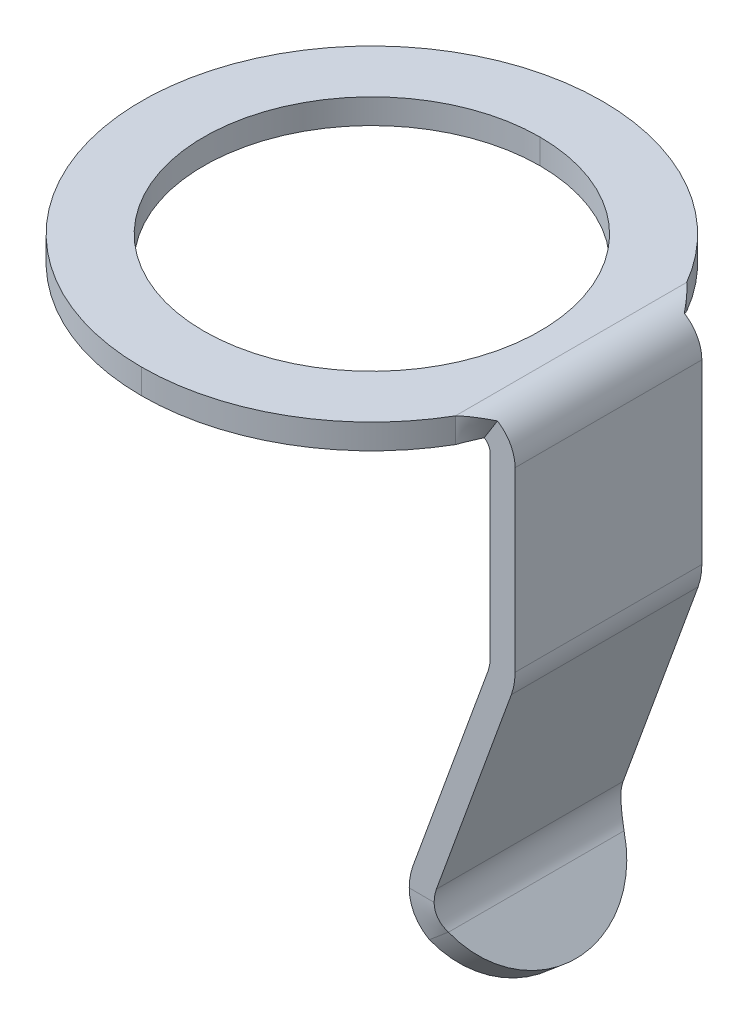
ISO-10303-21;
HEADER;
FILE_DESCRIPTION(('STEP AP214'),'2;1');
FILE_NAME('part.step','',(''),(''),'','','');
FILE_SCHEMA(('AUTOMOTIVE_DESIGN { 1 0 10303 214 1 1 1 1 }'));
ENDSEC;
DATA;
#1=APPLICATION_CONTEXT('core data for automotive mechanical design processes');
#2=APPLICATION_PROTOCOL_DEFINITION('international standard','automotive_design',2000,#1);
#3=PRODUCT_CONTEXT('',#1,'mechanical');
#4=PRODUCT('Part','Part','',(#3));
#5=PRODUCT_RELATED_PRODUCT_CATEGORY('part','',(#4));
#6=PRODUCT_DEFINITION_FORMATION('','',#4);
#7=PRODUCT_DEFINITION_CONTEXT('part definition',#1,'design');
#8=PRODUCT_DEFINITION('design','',#6,#7);
#9=PRODUCT_DEFINITION_SHAPE('','',#8);
#10=(LENGTH_UNIT() NAMED_UNIT(*) SI_UNIT(.MILLI.,.METRE.));
#11=(NAMED_UNIT(*) PLANE_ANGLE_UNIT() SI_UNIT($,.RADIAN.));
#12=(NAMED_UNIT(*) SI_UNIT($,.STERADIAN.) SOLID_ANGLE_UNIT());
#13=UNCERTAINTY_MEASURE_WITH_UNIT(LENGTH_MEASURE(1.E-05),#10,'distance_accuracy_value','');
#14=(GEOMETRIC_REPRESENTATION_CONTEXT(3) GLOBAL_UNCERTAINTY_ASSIGNED_CONTEXT((#13)) GLOBAL_UNIT_ASSIGNED_CONTEXT((#10,
#11,#12)) REPRESENTATION_CONTEXT('',''));
#15=CARTESIAN_POINT('',(0.,0.,0.));
#16=DIRECTION('',(0.,0.,1.));
#17=DIRECTION('',(1.,0.,0.));
#18=AXIS2_PLACEMENT_3D('',#15,#16,#17);
#19=CARTESIAN_POINT('',(-1.066044443119,-7.542787609687,4.));
#20=DIRECTION('',(-0.766044443119007,-0.642787609686505,0.));
#21=DIRECTION('',(-0.642787609686505,0.766044443119007,0.));
#22=AXIS2_PLACEMENT_3D('',#19,#20,#21);
#23=PLANE('',#22);
#24=CARTESIAN_POINT('',(-1.39484922021393,-7.15093333532141,0.));
#25=DIRECTION('',(0.766044443119006,0.642787609686506,0.));
#26=DIRECTION('',(-0.642787609686506,0.766044443119007,0.));
#27=AXIS2_PLACEMENT_3D('',#24,#25,#26);
#28=CIRCLE('',#27,1.5);
#29=CARTESIAN_POINT('',(-1.06604444311903,-7.54278760968672,1.41008426919146));
#30=VERTEX_POINT('',#29);
#31=CARTESIAN_POINT('',(-1.06604444311892,-7.54278760968658,-1.41008426919181));
#32=VERTEX_POINT('',#31);
#33=EDGE_CURVE('E11',#30,#32,#28,.T.);
#34=ORIENTED_EDGE('',*,*,#33,.F.);
#35=DIRECTION('',(0.,0.,1.));
#36=VECTOR('',#35,1.);
#37=CARTESIAN_POINT('',(-1.06604444311876,-7.5427876096868,4.));
#38=LINE('',#37,#36);
#39=EDGE_CURVE('E28',#32,#30,#38,.T.);
#40=ORIENTED_EDGE('',*,*,#39,.F.);
#41=EDGE_LOOP('',(#34,#40));
#42=FACE_BOUND('',#41,.T.);
#43=ADVANCED_FACE('F17',(#42),#23,.T.);
#44=CARTESIAN_POINT('',(-1.24164033159,-7.022375813384,0.));
#45=DIRECTION('',(0.766044443119007,0.642787609686505,0.));
#46=DIRECTION('',(-0.642787609686505,0.766044443119007,0.));
#47=AXIS2_PLACEMENT_3D('',#44,#45,#46);
#48=CYLINDRICAL_SURFACE('',#47,1.5);
#49=DIRECTION('',(-0.766044443120241,-0.642787609685034,0.));
#50=VECTOR('',#49,1.);
#51=CARTESIAN_POINT('',(-0.912876692884262,-7.41426460695659,-1.41008426919162));
#52=LINE('',#51,#50);
#53=CARTESIAN_POINT('',(-0.759626665871204,-7.28567256581219,-1.41008426919181));
#54=VERTEX_POINT('',#53);
#55=EDGE_CURVE('E279',#54,#32,#52,.T.);
#56=ORIENTED_EDGE('',*,*,#55,.F.);
#57=CARTESIAN_POINT('',(-1.08843144296639,-6.89381829144686,0.));
#58=DIRECTION('',(-0.766044443119006,-0.642787609686506,0.));
#59=DIRECTION('',(-0.642787609686506,0.766044443119007,0.));
#60=AXIS2_PLACEMENT_3D('',#57,#58,#59);
#61=CIRCLE('',#60,1.5);
#62=CARTESIAN_POINT('',(-0.759626665871298,-7.28567256581181,1.41008426919151));
#63=VERTEX_POINT('',#62);
#64=EDGE_CURVE('E192',#54,#63,#61,.T.);
#65=ORIENTED_EDGE('',*,*,#64,.T.);
#66=DIRECTION('',(-0.766044443119007,-0.642787609686505,0.));
#67=VECTOR('',#66,1.);
#68=CARTESIAN_POINT('',(-0.91283555449511,-7.41423008774901,1.41008426919154));
#69=LINE('',#68,#67);
#70=EDGE_CURVE('E193',#63,#30,#69,.T.);
#71=ORIENTED_EDGE('',*,*,#70,.T.);
#72=ORIENTED_EDGE('',*,*,#33,.T.);
#73=EDGE_LOOP('',(#56,#65,#71,#72));
#74=FACE_BOUND('',#73,.T.);
#75=ADVANCED_FACE('F303',(#74),#48,.T.);
#76=CARTESIAN_POINT('',(-0.3,-6.9,4.));
#77=DIRECTION('',(0.,0.,1.));
#78=DIRECTION('',(1.,0.,0.));
#79=AXIS2_PLACEMENT_3D('',#76,#77,#78);
#80=CYLINDRICAL_SURFACE('',#79,1.);
#81=CARTESIAN_POINT('',(-1.29973863530956,-6.87729710458656,1.499945644614));
#82=CARTESIAN_POINT('',(-1.29987384145526,-6.88314001843995,1.499981885997));
#83=CARTESIAN_POINT('',(-1.3016461980201,-7.00859734865777,1.500370746386));
#84=CARTESIAN_POINT('',(-1.25799426251989,-7.25376408101686,1.484823577251));
#85=CARTESIAN_POINT('',(-1.13542213086136,-7.46156779895759,1.438660254774));
#86=CARTESIAN_POINT('',(-1.05900488679946,-7.55110616142862,1.407189948817));
#87=CARTESIAN_POINT('',(-1.05544198904331,-7.55521074868514,1.405717663264));
#88=(BOUNDED_CURVE() B_SPLINE_CURVE(3,(#81,#82,#83,#84,#85,#86,#87),.UNSPECIFIED.,.F.,
.F.) B_SPLINE_CURVE_WITH_KNOTS((4,1,1,1,4),(-0.02442910242718,0.,0.5,1.,1.02424720941),
.UNSPECIFIED.) CURVE() GEOMETRIC_REPRESENTATION_ITEM() RATIONAL_B_SPLINE_CURVE((1.,1.,1.,1.,1.,
1.,1.)) REPRESENTATION_ITEM(''));
#89=CARTESIAN_POINT('',(-1.29998662667951,-6.89482830181338,1.49999999999995));
#90=VERTEX_POINT('',#89);
#91=EDGE_CURVE('E181',#90,#30,#88,.T.);
#92=ORIENTED_EDGE('',*,*,#91,.F.);
#93=CARTESIAN_POINT('',(-0.3,-6.9,1.5));
#94=DIRECTION('',(0.,0.,1.));
#95=DIRECTION('',(1.,0.,0.));
#96=AXIS2_PLACEMENT_3D('',#93,#94,#95);
#97=CIRCLE('',#96,1.);
#98=CARTESIAN_POINT('',(-1.23969262078594,-6.55797985667413,1.5));
#99=VERTEX_POINT('',#98);
#100=EDGE_CURVE('E186',#99,#90,#97,.T.);
#101=ORIENTED_EDGE('',*,*,#100,.F.);
#102=DIRECTION('',(0.,0.,1.));
#103=VECTOR('',#102,1.);
#104=CARTESIAN_POINT('',(-1.23969262078587,-6.55797985667405,4.));
#105=LINE('',#104,#103);
#106=CARTESIAN_POINT('',(-1.23969262078594,-6.55797985667413,-1.5));
#107=VERTEX_POINT('',#106);
#108=EDGE_CURVE('E152',#107,#99,#105,.T.);
#109=ORIENTED_EDGE('',*,*,#108,.F.);
#110=CARTESIAN_POINT('',(-0.3,-6.9,-1.5));
#111=DIRECTION('',(0.,0.,1.));
#112=DIRECTION('',(1.,0.,0.));
#113=AXIS2_PLACEMENT_3D('',#110,#111,#112);
#114=CIRCLE('',#113,1.);
#115=CARTESIAN_POINT('',(-1.29998662667951,-6.89482830181305,-1.50000000000017));
#116=VERTEX_POINT('',#115);
#117=EDGE_CURVE('E270',#107,#116,#114,.T.);
#118=ORIENTED_EDGE('',*,*,#117,.T.);
#119=CARTESIAN_POINT('',(-1.05545359878585,-7.55519737359482,-1.405722460706));
#120=CARTESIAN_POINT('',(-1.05901256477649,-7.55109716503239,-1.407193110772));
#121=CARTESIAN_POINT('',(-1.13542528260258,-7.46156245562721,-1.438661441787));
#122=CARTESIAN_POINT('',(-1.25799426251993,-7.25376408101687,-1.484823577251));
#123=CARTESIAN_POINT('',(-1.30164625639043,-7.00859702082559,-1.500370767175));
#124=CARTESIAN_POINT('',(-1.29987383219604,-6.88313936303207,-1.499981883966));
#125=CARTESIAN_POINT('',(-1.29973861256442,-6.87729612167255,-1.499945638518));
#126=(BOUNDED_CURVE() B_SPLINE_CURVE(3,(#119,#120,#121,#122,#123,#124,#125),.UNSPECIFIED.,.F.,
.F.) B_SPLINE_CURVE_WITH_KNOTS((4,1,1,1,4),(-0.02422087257923,0.,0.5,1.,1.024430472275),
.UNSPECIFIED.) CURVE() GEOMETRIC_REPRESENTATION_ITEM() RATIONAL_B_SPLINE_CURVE((1.,1.,1.,1.,1.,
1.,1.)) REPRESENTATION_ITEM(''));
#127=EDGE_CURVE('E167',#32,#116,#126,.T.);
#128=ORIENTED_EDGE('',*,*,#127,.F.);
#129=ORIENTED_EDGE('',*,*,#39,.T.);
#130=EDGE_LOOP('',(#92,#101,#109,#118,#128,#129));
#131=FACE_BOUND('',#130,.T.);
#132=ADVANCED_FACE('F184',(#131),#80,.T.);
#133=CARTESIAN_POINT('',(-1.07158855187,-7.569191057523,-1.405722460706));
#134=CARTESIAN_POINT('',(-0.9601318163994,-7.472525742185,-1.405722460706));
#135=CARTESIAN_POINT('',(-0.8486750809292,-7.375860426848,-1.405722460706));
#136=CARTESIAN_POINT('',(-0.7372183454589,-7.27919511151,-1.405722460706));
#137=CARTESIAN_POINT('',(-1.075223530139,-7.565003276841,-1.407193110772));
#138=CARTESIAN_POINT('',(-0.9632417184344,-7.468942890598,-1.407193110772));
#139=CARTESIAN_POINT('',(-0.8512599067296,-7.372882504354,-1.407193110772));
#140=CARTESIAN_POINT('',(-0.7392780950248,-7.27682211811,-1.407193110772));
#141=CARTESIAN_POINT('',(-1.153268268276,-7.473556288061,-1.438661441787));
#142=CARTESIAN_POINT('',(-1.030012816349,-7.390705510505,-1.438661441787));
#143=CARTESIAN_POINT('',(-0.9067573644216,-7.307854732949,-1.438661441787));
#144=CARTESIAN_POINT('',(-0.7835019124946,-7.225003955393,-1.438661441787));
#145=CARTESIAN_POINT('',(-1.27845507243,-7.261319762609,-1.484823577251));
#146=CARTESIAN_POINT('',(-1.137116261851,-7.209126762721,-1.484823577251));
#147=CARTESIAN_POINT('',(-0.9957774512727,-7.156933762833,-1.484823577251));
#148=CARTESIAN_POINT('',(-0.854438640694,-7.104740762945,-1.484823577251));
#149=CARTESIAN_POINT('',(-1.323039384148,-7.01091643242,-1.500370767175));
#150=CARTESIAN_POINT('',(-1.175260325298,-6.994894443191,-1.500370767175));
#151=CARTESIAN_POINT('',(-1.027481266448,-6.978872453961,-1.500370767175));
#152=CARTESIAN_POINT('',(-0.8797022075983,-6.962850464732,-1.500370767175));
#153=CARTESIAN_POINT('',(-1.321229104576,-6.882779254103,-1.499981883966));
#154=CARTESIAN_POINT('',(-1.173711542415,-6.885266808014,-1.499981883966));
#155=CARTESIAN_POINT('',(-1.026193980254,-6.887754361925,-1.499981883966));
#156=CARTESIAN_POINT('',(-0.8786764180927,-6.890241915837,-1.499981883966));
#157=CARTESIAN_POINT('',(-1.321090996928,-6.876811212987,-1.499945638518));
#158=CARTESIAN_POINT('',(-1.173593384554,-6.880160856386,-1.499945638518));
#159=CARTESIAN_POINT('',(-1.02609577218,-6.883510499786,-1.499945638518));
#160=CARTESIAN_POINT('',(-0.8785981598066,-6.886860143186,-1.499945638518));
#161=(BOUNDED_SURFACE() B_SPLINE_SURFACE(3,3,((#133,#134,#135,#136),(#137,#138,#139,#140),(#141,
#142,#143,#144),(#145,#146,#147,#148),(#149,#150,#151,#152),(#153,#154,#155,#156),(#157,#158,
#159,#160)),.UNSPECIFIED.,.F.,.F.,.F.) B_SPLINE_SURFACE_WITH_KNOTS((4,1,1,1,4),(4,4),
(-0.02422087257923,0.,0.5,1.,1.024430472275),(-0.05339491767018,1.053126405904),
.UNSPECIFIED.) GEOMETRIC_REPRESENTATION_ITEM() RATIONAL_B_SPLINE_SURFACE(((1.,1.,1.,1.),(1.,1.,
1.,1.),(1.,1.,1.,1.),(1.,1.,1.,1.),(1.,1.,1.,1.),(1.,1.,1.,1.),(1.,1.,1.,1.))) REPRESENTATION_ITEM('') SURFACE());
#162=DIRECTION('',(0.999986626679514,-0.00517169818593002,0.));
#163=VECTOR('',#162,1.);
#164=CARTESIAN_POINT('',(-1.10004300297853,-6.8958623637179,-1.50000000000034));
#165=LINE('',#164,#163);
#166=CARTESIAN_POINT('',(-0.899991976007704,-6.89689698108762,-1.50000000000017));
#167=VERTEX_POINT('',#166);
#168=EDGE_CURVE('E267',#116,#167,#165,.T.);
#169=CARTESIAN_POINT('',(-0.899843167538279,-6.8863776730037,-1.499945638518));
#170=CARTESIAN_POINT('',(-0.899924299317655,-6.88988361781955,-1.499981883966));
#171=CARTESIAN_POINT('',(-0.900987753834085,-6.96515821249531,-1.500370767175));
#172=CARTESIAN_POINT('',(-0.874796557511855,-7.11225844860999,-1.484823577251));
#173=CARTESIAN_POINT('',(-0.801255169561105,-7.23693747337631,-1.438661441787));
#174=CARTESIAN_POINT('',(-0.755407538865916,-7.29065829901912,-1.407193110772));
#175=CARTESIAN_POINT('',(-0.753272159271284,-7.29311842415686,-1.405722460706));
#176=(BOUNDED_CURVE() B_SPLINE_CURVE(3,(#169,#170,#171,#172,#173,#174,#175),.UNSPECIFIED.,.F.,
.F.) B_SPLINE_CURVE_WITH_KNOTS((4,1,1,1,4),(-0.0242208725792301,0.000209599695769835,
0.50020959969577,1.00020959969577,1.024430472275),
.UNSPECIFIED.) CURVE() GEOMETRIC_REPRESENTATION_ITEM() RATIONAL_B_SPLINE_CURVE((1.,1.,1.,1.,1.,
1.,1.)) REPRESENTATION_ITEM(''));
#177=EDGE_CURVE('E350',#167,#54,#176,.T.);
#178=ORIENTED_EDGE('',*,*,#168,.T.);
#179=ORIENTED_EDGE('',*,*,#177,.T.);
#180=ORIENTED_EDGE('',*,*,#55,.T.);
#181=ORIENTED_EDGE('',*,*,#127,.T.);
#182=EDGE_LOOP('',(#178,#179,#180,#181));
#183=FACE_BOUND('',#182,.T.);
#184=ADVANCED_FACE('F302',(#183),#161,.T.);
#185=CARTESIAN_POINT('',(-0.7596266658714,-7.285672565812,4.));
#186=DIRECTION('',(-0.766044443119007,-0.642787609686505,0.));
#187=DIRECTION('',(-0.642787609686505,0.766044443119007,0.));
#188=AXIS2_PLACEMENT_3D('',#185,#186,#187);
#189=PLANE('',#188);
#190=DIRECTION('',(0.,0.,1.));
#191=VECTOR('',#190,1.);
#192=CARTESIAN_POINT('',(-0.759626665871355,-7.28567256581196,4.));
#193=LINE('',#192,#191);
#194=EDGE_CURVE('E381',#54,#63,#193,.T.);
#195=ORIENTED_EDGE('',*,*,#194,.T.);
#196=ORIENTED_EDGE('',*,*,#64,.F.);
#197=EDGE_LOOP('',(#195,#196));
#198=FACE_BOUND('',#197,.T.);
#199=ADVANCED_FACE('F246',(#198),#189,.F.);
#200=CARTESIAN_POINT('',(-1.321091020159,-6.876812216894,1.499945644614));
#201=CARTESIAN_POINT('',(-1.173593404429,-6.880161715278,1.499945644614));
#202=CARTESIAN_POINT('',(-1.0260957887,-6.883511213663,1.499945644614));
#203=CARTESIAN_POINT('',(-0.8785981729704,-6.886860712047,1.499945644614));
#204=CARTESIAN_POINT('',(-1.321229114033,-6.882779923509,1.499981885997));
#205=CARTESIAN_POINT('',(-1.173711550506,-6.885267380724,1.499981885997));
#206=CARTESIAN_POINT('',(-1.026193986979,-6.887754837939,1.499981885997));
#207=CARTESIAN_POINT('',(-0.8786764234514,-6.890242295153,1.499981885997));
#208=CARTESIAN_POINT('',(-1.323039324531,-7.010916767254,1.500370746386));
#209=CARTESIAN_POINT('',(-1.175260274293,-6.994894729658,1.500370746386));
#210=CARTESIAN_POINT('',(-1.027481224055,-6.978872692061,1.500370746386));
#211=CARTESIAN_POINT('',(-0.8797021738164,-6.962850654465,1.500370746386));
#212=CARTESIAN_POINT('',(-1.27845507243,-7.261319762609,1.484823577251));
#213=CARTESIAN_POINT('',(-1.137116261851,-7.209126762721,1.484823577251));
#214=CARTESIAN_POINT('',(-0.9957774512727,-7.156933762833,1.484823577251));
#215=CARTESIAN_POINT('',(-0.854438640694,-7.104740762945,1.484823577251));
#216=CARTESIAN_POINT('',(-1.15326504922,-7.473561745514,1.438660254774));
#217=CARTESIAN_POINT('',(-1.030010062289,-7.390710179624,1.438660254774));
#218=CARTESIAN_POINT('',(-0.9067550753578,-7.307858613733,1.438660254774));
#219=CARTESIAN_POINT('',(-0.7835000884266,-7.225007047843,1.438660254774));
#220=CARTESIAN_POINT('',(-1.075215688176,-7.565012465382,1.407189948817));
#221=CARTESIAN_POINT('',(-0.9632350092509,-7.468950751845,1.407189948817));
#222=CARTESIAN_POINT('',(-0.8512543303254,-7.372889038307,1.407189948817));
#223=CARTESIAN_POINT('',(-0.7392736514,-7.27682732477,1.407189948817));
#224=CARTESIAN_POINT('',(-1.071576694167,-7.569204718278,1.405717663264));
#225=CARTESIAN_POINT('',(-0.9601216715533,-7.472537429631,1.405717663264));
#226=CARTESIAN_POINT('',(-0.8486666489401,-7.375870140983,1.405717663264));
#227=CARTESIAN_POINT('',(-0.7372116263268,-7.279202852336,1.405717663264));
#228=(BOUNDED_SURFACE() B_SPLINE_SURFACE(3,3,((#200,#201,#202,#203),(#204,#205,#206,#207),(#208,
#209,#210,#211),(#212,#213,#214,#215),(#216,#217,#218,#219),(#220,#221,#222,#223),(#224,#225,
#226,#227)),.UNSPECIFIED.,.F.,.F.,.F.) B_SPLINE_SURFACE_WITH_KNOTS((4,1,1,1,4),(4,4),
(-0.02442910242718,0.,0.5,1.,1.02424720941),(-0.05339491767018,1.053126405904),
.UNSPECIFIED.) GEOMETRIC_REPRESENTATION_ITEM() RATIONAL_B_SPLINE_SURFACE(((1.,1.,1.,1.),(1.,1.,
1.,1.),(1.,1.,1.,1.),(1.,1.,1.,1.),(1.,1.,1.,1.),(1.,1.,1.,1.),(1.,1.,1.,1.))) REPRESENTATION_ITEM('') SURFACE());
#229=CARTESIAN_POINT('',(-0.753265193425411,-7.29312644921077,1.405717663264));
#230=CARTESIAN_POINT('',(-0.755402932079564,-7.29066369685729,1.407189948817));
#231=CARTESIAN_POINT('',(-0.801253278516594,-7.23694067937485,1.438660254774));
#232=CARTESIAN_POINT('',(-0.874796557511578,-7.11225844860989,1.484823577251));
#233=CARTESIAN_POINT('',(-0.900987718811578,-6.96515840919488,1.500370746386));
#234=CARTESIAN_POINT('',(-0.89992430487286,-6.88988401106356,1.499981885997));
#235=CARTESIAN_POINT('',(-0.899843181185197,-6.88637826275226,1.499945644614));
#236=(BOUNDED_CURVE() B_SPLINE_CURVE(3,(#229,#230,#231,#232,#233,#234,#235),.UNSPECIFIED.,.F.,
.F.) B_SPLINE_CURVE_WITH_KNOTS((4,1,1,1,4),(-0.02442910242718,-0.000181893017179857,
0.49981810698282,0.99981810698282,1.02424720941),
.UNSPECIFIED.) CURVE() GEOMETRIC_REPRESENTATION_ITEM() RATIONAL_B_SPLINE_CURVE((1.,1.,1.,1.,1.,
1.,1.)) REPRESENTATION_ITEM(''));
#237=CARTESIAN_POINT('',(-0.899991976007708,-6.89689698108836,1.49999999999995));
#238=VERTEX_POINT('',#237);
#239=EDGE_CURVE('E200',#63,#238,#236,.T.);
#240=DIRECTION('',(-0.999986626679507,0.00517169818737915,0.));
#241=VECTOR('',#240,1.);
#242=CARTESIAN_POINT('',(-1.10004300297865,-6.89586236371888,1.4999999999999));
#243=LINE('',#242,#241);
#244=EDGE_CURVE('E197',#238,#90,#243,.T.);
#245=ORIENTED_EDGE('',*,*,#70,.F.);
#246=ORIENTED_EDGE('',*,*,#239,.T.);
#247=ORIENTED_EDGE('',*,*,#244,.T.);
#248=ORIENTED_EDGE('',*,*,#91,.T.);
#249=EDGE_LOOP('',(#245,#246,#247,#248));
#250=FACE_BOUND('',#249,.T.);
#251=ADVANCED_FACE('F198',(#250),#228,.T.);
#252=CARTESIAN_POINT('',(-0.03618442752846,-3.251368271571,4.));
#253=DIRECTION('',(-0.939692620785897,0.342020143325699,0.));
#254=DIRECTION('',(0.,0.,1.));
#255=AXIS2_PLACEMENT_3D('',#252,#253,#254);
#256=PLANE('',#255);
#257=ORIENTED_EDGE('',*,*,#108,.T.);
#258=DIRECTION('',(-0.342020143325734,-0.939692620785885,0.));
#259=VECTOR('',#258,1.);
#260=CARTESIAN_POINT('',(-0.03618442752846,-3.251368271571,1.5));
#261=LINE('',#260,#259);
#262=CARTESIAN_POINT('',(-0.0361844275284646,-3.25136827157072,1.5));
#263=VERTEX_POINT('',#262);
#264=EDGE_CURVE('E211',#263,#99,#261,.T.);
#265=ORIENTED_EDGE('',*,*,#264,.F.);
#266=DIRECTION('',(0.,0.,-1.));
#267=VECTOR('',#266,1.);
#268=CARTESIAN_POINT('',(-0.0361844275286479,-3.25136827157093,4.));
#269=LINE('',#268,#267);
#270=CARTESIAN_POINT('',(-0.0361844275284646,-3.25136827157072,-1.5));
#271=VERTEX_POINT('',#270);
#272=EDGE_CURVE('E385',#263,#271,#269,.T.);
#273=ORIENTED_EDGE('',*,*,#272,.T.);
#274=DIRECTION('',(-0.342020143325734,-0.939692620785885,0.));
#275=VECTOR('',#274,1.);
#276=CARTESIAN_POINT('',(-0.03618442752846,-3.251368271571,-1.5));
#277=LINE('',#276,#275);
#278=EDGE_CURVE('E276',#271,#107,#277,.T.);
#279=ORIENTED_EDGE('',*,*,#278,.T.);
#280=EDGE_LOOP('',(#257,#265,#273,#279));
#281=FACE_BOUND('',#280,.T.);
#282=ADVANCED_FACE('F245',(#281),#256,.T.);
#283=CARTESIAN_POINT('',(-0.3,-6.9,4.));
#284=DIRECTION('',(0.,0.,1.));
#285=DIRECTION('',(1.,0.,0.));
#286=AXIS2_PLACEMENT_3D('',#283,#284,#285);
#287=CYLINDRICAL_SURFACE('',#286,0.6);
#288=ORIENTED_EDGE('',*,*,#194,.F.);
#289=ORIENTED_EDGE('',*,*,#177,.F.);
#290=CARTESIAN_POINT('',(-0.3,-6.9,-1.5));
#291=DIRECTION('',(0.,0.,1.));
#292=DIRECTION('',(1.,0.,0.));
#293=AXIS2_PLACEMENT_3D('',#290,#291,#292);
#294=CIRCLE('',#293,0.6);
#295=CARTESIAN_POINT('',(-0.863815572471685,-6.69478791400475,-1.5));
#296=VERTEX_POINT('',#295);
#297=EDGE_CURVE('E271',#296,#167,#294,.T.);
#298=ORIENTED_EDGE('',*,*,#297,.F.);
#299=DIRECTION('',(0.,0.,1.));
#300=VECTOR('',#299,1.);
#301=CARTESIAN_POINT('',(-0.863815572471832,-6.69478791400492,4.));
#302=LINE('',#301,#300);
#303=CARTESIAN_POINT('',(-0.863815572471685,-6.69478791400475,1.5));
#304=VERTEX_POINT('',#303);
#305=EDGE_CURVE('E482',#296,#304,#302,.T.);
#306=ORIENTED_EDGE('',*,*,#305,.T.);
#307=CARTESIAN_POINT('',(-0.3,-6.9,1.5));
#308=DIRECTION('',(0.,0.,-1.));
#309=DIRECTION('',(1.,0.,0.));
#310=AXIS2_PLACEMENT_3D('',#307,#308,#309);
#311=CIRCLE('',#310,0.6);
#312=EDGE_CURVE('E206',#238,#304,#311,.T.);
#313=ORIENTED_EDGE('',*,*,#312,.F.);
#314=ORIENTED_EDGE('',*,*,#239,.F.);
#315=EDGE_LOOP('',(#288,#289,#298,#306,#313,#314));
#316=FACE_BOUND('',#315,.T.);
#317=ADVANCED_FACE('F356',(#316),#287,.F.);
#318=CARTESIAN_POINT('',(-0.6,-3.046156185575,4.));
#319=DIRECTION('',(0.,0.,1.));
#320=DIRECTION('',(1.,0.,0.));
#321=AXIS2_PLACEMENT_3D('',#318,#319,#320);
#322=CYLINDRICAL_SURFACE('',#321,0.6);
#323=CARTESIAN_POINT('',(-0.6,-3.046156185575,-1.5));
#324=DIRECTION('',(0.,0.,-1.));
#325=DIRECTION('',(1.,0.,0.));
#326=AXIS2_PLACEMENT_3D('',#323,#324,#325);
#327=CIRCLE('',#326,0.6);
#328=CARTESIAN_POINT('',(0.,-3.046156185575,-1.5));
#329=VERTEX_POINT('',#328);
#330=EDGE_CURVE('E492',#329,#271,#327,.T.);
#331=ORIENTED_EDGE('',*,*,#330,.T.);
#332=ORIENTED_EDGE('',*,*,#272,.F.);
#333=CARTESIAN_POINT('',(-0.6,-3.046156185575,1.5));
#334=DIRECTION('',(0.,0.,-1.));
#335=DIRECTION('',(1.,0.,0.));
#336=AXIS2_PLACEMENT_3D('',#333,#334,#335);
#337=CIRCLE('',#336,0.6);
#338=CARTESIAN_POINT('',(0.,-3.046156185575,1.5));
#339=VERTEX_POINT('',#338);
#340=EDGE_CURVE('E218',#339,#263,#337,.T.);
#341=ORIENTED_EDGE('',*,*,#340,.F.);
#342=DIRECTION('',(0.,0.,1.));
#343=VECTOR('',#342,1.);
#344=CARTESIAN_POINT('',(0.,-3.046156185575,4.));
#345=LINE('',#344,#343);
#346=EDGE_CURVE('E485',#329,#339,#345,.T.);
#347=ORIENTED_EDGE('',*,*,#346,.F.);
#348=EDGE_LOOP('',(#331,#332,#341,#347));
#349=FACE_BOUND('',#348,.T.);
#350=ADVANCED_FACE('F365',(#349),#322,.F.);
#351=CARTESIAN_POINT('',(0.3396926207859,-3.388176328901,4.));
#352=DIRECTION('',(-0.939692620785897,0.342020143325699,0.));
#353=DIRECTION('',(0.,0.,1.));
#354=AXIS2_PLACEMENT_3D('',#351,#352,#353);
#355=PLANE('',#354);
#356=DIRECTION('',(-0.342020143325699,-0.939692620785897,0.));
#357=VECTOR('',#356,1.);
#358=CARTESIAN_POINT('',(0.3396926207859,-3.388176328901,-1.5));
#359=LINE('',#358,#357);
#360=CARTESIAN_POINT('',(0.339692620785899,-3.38817632890085,-1.5));
#361=VERTEX_POINT('',#360);
#362=EDGE_CURVE('E531',#361,#296,#359,.T.);
#363=ORIENTED_EDGE('',*,*,#362,.F.);
#364=DIRECTION('',(0.,0.,-1.));
#365=VECTOR('',#364,1.);
#366=CARTESIAN_POINT('',(0.339692620785801,-3.38817632890097,4.));
#367=LINE('',#366,#365);
#368=CARTESIAN_POINT('',(0.339692620785899,-3.38817632890085,1.5));
#369=VERTEX_POINT('',#368);
#370=EDGE_CURVE('E425',#369,#361,#367,.T.);
#371=ORIENTED_EDGE('',*,*,#370,.F.);
#372=DIRECTION('',(0.342020143325699,0.939692620785897,0.));
#373=VECTOR('',#372,1.);
#374=CARTESIAN_POINT('',(0.3396926207859,-3.388176328901,1.5));
#375=LINE('',#374,#373);
#376=EDGE_CURVE('E389',#304,#369,#375,.T.);
#377=ORIENTED_EDGE('',*,*,#376,.F.);
#378=ORIENTED_EDGE('',*,*,#305,.F.);
#379=EDGE_LOOP('',(#363,#371,#377,#378));
#380=FACE_BOUND('',#379,.T.);
#381=ADVANCED_FACE('F681',(#380),#355,.F.);
#382=CARTESIAN_POINT('',(0.,-0.2,4.));
#383=DIRECTION('',(-1.,0.,0.));
#384=DIRECTION('',(0.,0.,1.));
#385=AXIS2_PLACEMENT_3D('',#382,#383,#384);
#386=PLANE('',#385);
#387=ORIENTED_EDGE('',*,*,#346,.T.);
#388=DIRECTION('',(0.,-1.,0.));
#389=VECTOR('',#388,1.);
#390=CARTESIAN_POINT('',(0.,-1.623078092788,1.5));
#391=LINE('',#390,#389);
#392=CARTESIAN_POINT('',(0.,-0.2,1.5));
#393=VERTEX_POINT('',#392);
#394=EDGE_CURVE('E459',#393,#339,#391,.T.);
#395=ORIENTED_EDGE('',*,*,#394,.F.);
#396=DIRECTION('',(0.,0.,-1.));
#397=VECTOR('',#396,1.);
#398=CARTESIAN_POINT('',(0.,-0.2,4.));
#399=LINE('',#398,#397);
#400=CARTESIAN_POINT('',(0.,-0.2,-1.5));
#401=VERTEX_POINT('',#400);
#402=EDGE_CURVE('E406',#393,#401,#399,.T.);
#403=ORIENTED_EDGE('',*,*,#402,.T.);
#404=DIRECTION('',(0.,-1.,0.));
#405=VECTOR('',#404,1.);
#406=CARTESIAN_POINT('',(0.,-1.623078092788,-1.5));
#407=LINE('',#406,#405);
#408=EDGE_CURVE('E442',#401,#329,#407,.T.);
#409=ORIENTED_EDGE('',*,*,#408,.T.);
#410=EDGE_LOOP('',(#387,#395,#403,#409));
#411=FACE_BOUND('',#410,.T.);
#412=ADVANCED_FACE('F685',(#411),#386,.T.);
#413=CARTESIAN_POINT('',(-0.6,-3.046156185575,4.));
#414=DIRECTION('',(0.,0.,1.));
#415=DIRECTION('',(1.,0.,0.));
#416=AXIS2_PLACEMENT_3D('',#413,#414,#415);
#417=CYLINDRICAL_SURFACE('',#416,1.);
#418=DIRECTION('',(0.,0.,1.));
#419=VECTOR('',#418,1.);
#420=CARTESIAN_POINT('',(0.4,-3.046156185575,4.));
#421=LINE('',#420,#419);
#422=CARTESIAN_POINT('',(0.4,-3.046156185575,-1.5));
#423=VERTEX_POINT('',#422);
#424=CARTESIAN_POINT('',(0.4,-3.046156185575,1.5));
#425=VERTEX_POINT('',#424);
#426=EDGE_CURVE('E462',#423,#425,#421,.T.);
#427=ORIENTED_EDGE('',*,*,#426,.T.);
#428=CARTESIAN_POINT('',(-0.6,-3.046156185575,1.5));
#429=DIRECTION('',(0.,0.,-1.));
#430=DIRECTION('',(1.,0.,0.));
#431=AXIS2_PLACEMENT_3D('',#428,#429,#430);
#432=CIRCLE('',#431,1.);
#433=EDGE_CURVE('E396',#425,#369,#432,.T.);
#434=ORIENTED_EDGE('',*,*,#433,.T.);
#435=ORIENTED_EDGE('',*,*,#370,.T.);
#436=CARTESIAN_POINT('',(-0.6,-3.046156185575,-1.5));
#437=DIRECTION('',(0.,0.,1.));
#438=DIRECTION('',(1.,0.,0.));
#439=AXIS2_PLACEMENT_3D('',#436,#437,#438);
#440=CIRCLE('',#439,1.);
#441=EDGE_CURVE('E455',#361,#423,#440,.T.);
#442=ORIENTED_EDGE('',*,*,#441,.T.);
#443=EDGE_LOOP('',(#427,#434,#435,#442));
#444=FACE_BOUND('',#443,.T.);
#445=ADVANCED_FACE('F675',(#444),#417,.T.);
#446=CARTESIAN_POINT('',(-0.2,-0.2,4.));
#447=DIRECTION('',(0.,0.,1.));
#448=DIRECTION('',(1.,0.,0.));
#449=AXIS2_PLACEMENT_3D('',#446,#447,#448);
#450=CYLINDRICAL_SURFACE('',#449,0.2);
#451=ORIENTED_EDGE('',*,*,#402,.F.);
#452=CARTESIAN_POINT('',(-0.2,-0.2,1.5));
#453=DIRECTION('',(0.,0.,1.));
#454=DIRECTION('',(1.,0.,0.));
#455=AXIS2_PLACEMENT_3D('',#452,#453,#454);
#456=CIRCLE('',#455,0.2);
#457=CARTESIAN_POINT('',(-0.0942780935743456,-0.0302269794645652,1.49999999999879));
#458=VERTEX_POINT('',#457);
#459=EDGE_CURVE('E470',#393,#458,#456,.T.);
#460=ORIENTED_EDGE('',*,*,#459,.T.);
#461=CARTESIAN_POINT('',(-0.2,0.,1.85741756210083));
#462=CARTESIAN_POINT('',(-0.188853304027263,0.,1.82598828584508));
#463=CARTESIAN_POINT('',(-0.178082660134872,-0.000929849982014446,1.79441337970195));
#464=CARTESIAN_POINT('',(-0.167764946103394,-0.00261484022276943,1.76274709128459));
#465=CARTESIAN_POINT('',(-0.157448212205413,-0.00429967039750838,1.7310838110132));
#466=CARTESIAN_POINT('',(-0.147576686866394,-0.00674228496147656,1.69930603964969));
#467=CARTESIAN_POINT('',(-0.138221632899082,-0.00978056524544037,1.66744558160578));
#468=CARTESIAN_POINT('',(-0.121919320547173,-0.0150751358994303,1.61192488225742));
#469=CARTESIAN_POINT('',(-0.107178582439179,-0.0221935223680607,1.55608374877247));
#470=CARTESIAN_POINT('',(-0.0942780935743456,-0.0302269794645652,1.49999999999879));
#471=(BOUNDED_CURVE() B_SPLINE_CURVE(3,(#461,#462,#463,#464,#465,#466,#467,#468,#469,#470),
.UNSPECIFIED.,.F.,.F.) B_SPLINE_CURVE_WITH_KNOTS((4,3,3,4),(0.,0.000100042161780453,
0.000200068969384196,0.000374457637938322),
.UNSPECIFIED.) CURVE() GEOMETRIC_REPRESENTATION_ITEM() RATIONAL_B_SPLINE_CURVE((1.,1.,1.,1.,1.,
1.,1.,1.,1.,1.)) REPRESENTATION_ITEM(''));
#472=CARTESIAN_POINT('',(-0.2,0.,1.85741756210083));
#473=VERTEX_POINT('',#472);
#474=EDGE_CURVE('E426',#473,#458,#471,.T.);
#475=ORIENTED_EDGE('',*,*,#474,.F.);
#476=DIRECTION('',(0.,0.,1.));
#477=VECTOR('',#476,1.);
#478=CARTESIAN_POINT('',(-0.2,0.,4.));
#479=LINE('',#478,#477);
#480=CARTESIAN_POINT('',(-0.200000000000074,0.,-1.85741756210071));
#481=VERTEX_POINT('',#480);
#482=EDGE_CURVE('E490',#481,#473,#479,.T.);
#483=ORIENTED_EDGE('',*,*,#482,.F.);
#484=CARTESIAN_POINT('',(-0.094278093574714,-0.0302269794643357,-1.50000000000005));
#485=CARTESIAN_POINT('',(-0.101680198091082,-0.0256175038328871,-1.53218000297858));
#486=CARTESIAN_POINT('',(-0.109682778339572,-0.0213082257336406,-1.56427318621991));
#487=CARTESIAN_POINT('',(-0.118241586094724,-0.0174744901234526,-1.59626756525503));
#488=CARTESIAN_POINT('',(-0.126800768400355,-0.0136405867413568,-1.62826334442792));
#489=CARTESIAN_POINT('',(-0.135919533259224,-0.0102804071842455,-1.66017640887588));
#490=CARTESIAN_POINT('',(-0.145533387095943,-0.00755939077533655,-1.69198612729452));
#491=CARTESIAN_POINT('',(-0.16228896823447,-0.00281704582261823,-1.74742594643567));
#492=CARTESIAN_POINT('',(-0.180576037058964,0.,-1.80264966507121));
#493=CARTESIAN_POINT('',(-0.200000000000074,0.,-1.85741756210071));
#494=(BOUNDED_CURVE() B_SPLINE_CURVE(3,(#484,#485,#486,#487,#488,#489,#490,#491,#492,#493),
.UNSPECIFIED.,.F.,.F.) B_SPLINE_CURVE_WITH_KNOTS((4,3,3,4),(0.,0.00010002159306303,
0.000200050634522067,0.000374519144466621),
.UNSPECIFIED.) CURVE() GEOMETRIC_REPRESENTATION_ITEM() RATIONAL_B_SPLINE_CURVE((1.,1.,1.,1.,1.,
1.,1.,1.,1.,1.)) REPRESENTATION_ITEM(''));
#495=CARTESIAN_POINT('',(-0.094278093574714,-0.0302269794643357,-1.50000000000005));
#496=VERTEX_POINT('',#495);
#497=EDGE_CURVE('E456',#496,#481,#494,.T.);
#498=ORIENTED_EDGE('',*,*,#497,.F.);
#499=CARTESIAN_POINT('',(-0.2,-0.2,-1.5));
#500=DIRECTION('',(0.,0.,1.));
#501=DIRECTION('',(1.,0.,0.));
#502=AXIS2_PLACEMENT_3D('',#499,#500,#501);
#503=CIRCLE('',#502,0.2);
#504=EDGE_CURVE('E434',#401,#496,#503,.T.);
#505=ORIENTED_EDGE('',*,*,#504,.F.);
#506=EDGE_LOOP('',(#451,#460,#475,#483,#498,#505));
#507=FACE_BOUND('',#506,.T.);
#508=ADVANCED_FACE('F671',(#507),#450,.F.);
#509=CARTESIAN_POINT('',(0.1482330852083,0.2,1.5));
#510=DIRECTION('',(0.,0.,-1.));
#511=DIRECTION('',(0.,-1.,0.));
#512=AXIS2_PLACEMENT_3D('',#509,#510,#511);
#513=PLANE('',#512);
#514=ORIENTED_EDGE('',*,*,#459,.F.);
#515=ORIENTED_EDGE('',*,*,#394,.T.);
#516=ORIENTED_EDGE('',*,*,#340,.T.);
#517=ORIENTED_EDGE('',*,*,#264,.T.);
#518=ORIENTED_EDGE('',*,*,#100,.T.);
#519=ORIENTED_EDGE('',*,*,#244,.F.);
#520=ORIENTED_EDGE('',*,*,#312,.T.);
#521=ORIENTED_EDGE('',*,*,#376,.T.);
#522=ORIENTED_EDGE('',*,*,#433,.F.);
#523=DIRECTION('',(0.,1.,0.));
#524=VECTOR('',#523,1.);
#525=CARTESIAN_POINT('',(0.4,-0.2,1.5));
#526=LINE('',#525,#524);
#527=CARTESIAN_POINT('',(0.4,-0.2,1.5));
#528=VERTEX_POINT('',#527);
#529=EDGE_CURVE('E441',#425,#528,#526,.T.);
#530=ORIENTED_EDGE('',*,*,#529,.T.);
#531=CARTESIAN_POINT('',(-0.2,-0.2,1.5));
#532=DIRECTION('',(0.,0.,-1.));
#533=DIRECTION('',(1.,0.,0.));
#534=AXIS2_PLACEMENT_3D('',#531,#532,#533);
#535=CIRCLE('',#534,0.6);
#536=CARTESIAN_POINT('',(0.117165719276003,0.309319061606902,1.50000000000043));
#537=VERTEX_POINT('',#536);
#538=EDGE_CURVE('E491',#537,#528,#535,.T.);
#539=ORIENTED_EDGE('',*,*,#538,.F.);
#540=DIRECTION('',(0.528609532126886,0.848865102678037,1.16434387941993E-12));
#541=VECTOR('',#540,1.);
#542=CARTESIAN_POINT('',(0.0114473897053586,0.139551784946248,1.50000000000021));
#543=LINE('',#542,#541);
#544=EDGE_CURVE('E433',#458,#537,#543,.T.);
#545=ORIENTED_EDGE('',*,*,#544,.F.);
#546=EDGE_LOOP('',(#514,#515,#516,#517,#518,#519,#520,#521,#522,#530,#539,#545));
#547=FACE_BOUND('',#546,.T.);
#548=ADVANCED_FACE('F19',(#547),#513,.F.);
#549=CARTESIAN_POINT('',(0.4,-0.2,4.));
#550=DIRECTION('',(-1.,0.,0.));
#551=DIRECTION('',(0.,0.,1.));
#552=AXIS2_PLACEMENT_3D('',#549,#550,#551);
#553=PLANE('',#552);
#554=DIRECTION('',(0.,-1.,0.));
#555=VECTOR('',#554,1.);
#556=CARTESIAN_POINT('',(0.4,-0.2,-1.5));
#557=LINE('',#556,#555);
#558=CARTESIAN_POINT('',(0.4,-0.2,-1.5));
#559=VERTEX_POINT('',#558);
#560=EDGE_CURVE('E451',#559,#423,#557,.T.);
#561=ORIENTED_EDGE('',*,*,#560,.F.);
#562=DIRECTION('',(0.,0.,-1.));
#563=VECTOR('',#562,1.);
#564=CARTESIAN_POINT('',(0.4,-0.2,4.));
#565=LINE('',#564,#563);
#566=EDGE_CURVE('E486',#528,#559,#565,.T.);
#567=ORIENTED_EDGE('',*,*,#566,.F.);
#568=ORIENTED_EDGE('',*,*,#529,.F.);
#569=ORIENTED_EDGE('',*,*,#426,.F.);
#570=EDGE_LOOP('',(#561,#567,#568,#569));
#571=FACE_BOUND('',#570,.T.);
#572=ADVANCED_FACE('F318',(#571),#553,.F.);
#573=CARTESIAN_POINT('',(0.1482330852083,0.2,-1.5));
#574=DIRECTION('',(0.,0.,-1.));
#575=DIRECTION('',(0.,-1.,0.));
#576=AXIS2_PLACEMENT_3D('',#573,#574,#575);
#577=PLANE('',#576);
#578=DIRECTION('',(-0.528609532126507,-0.848865102678273,1.99349785415846E-12));
#579=VECTOR('',#578,1.);
#580=CARTESIAN_POINT('',(0.0114473897052243,0.139551784946323,-1.50000000000009));
#581=LINE('',#580,#579);
#582=CARTESIAN_POINT('',(0.117165719275851,0.309319061606997,-1.5000000000006));
#583=VERTEX_POINT('',#582);
#584=EDGE_CURVE('E432',#583,#496,#581,.T.);
#585=ORIENTED_EDGE('',*,*,#584,.F.);
#586=CARTESIAN_POINT('',(-0.2,-0.2,-1.5));
#587=DIRECTION('',(0.,0.,1.));
#588=DIRECTION('',(1.,0.,0.));
#589=AXIS2_PLACEMENT_3D('',#586,#587,#588);
#590=CIRCLE('',#589,0.6);
#591=EDGE_CURVE('E1007',#559,#583,#590,.T.);
#592=ORIENTED_EDGE('',*,*,#591,.F.);
#593=ORIENTED_EDGE('',*,*,#560,.T.);
#594=ORIENTED_EDGE('',*,*,#441,.F.);
#595=ORIENTED_EDGE('',*,*,#362,.T.);
#596=ORIENTED_EDGE('',*,*,#297,.T.);
#597=ORIENTED_EDGE('',*,*,#168,.F.);
#598=ORIENTED_EDGE('',*,*,#117,.F.);
#599=ORIENTED_EDGE('',*,*,#278,.F.);
#600=ORIENTED_EDGE('',*,*,#330,.F.);
#601=ORIENTED_EDGE('',*,*,#408,.F.);
#602=ORIENTED_EDGE('',*,*,#504,.T.);
#603=EDGE_LOOP('',(#585,#592,#593,#594,#595,#596,#597,#598,#599,#600,#601,#602));
#604=FACE_BOUND('',#603,.T.);
#605=ADVANCED_FACE('F306',(#604),#577,.T.);
#606=CARTESIAN_POINT('',(-0.1033823970473,-0.04959997541605,-1.489577269699));
#607=CARTESIAN_POINT('',(-0.02366072876773,0.074496662672,-1.489577271943));
#608=CARTESIAN_POINT('',(0.0560609395118,0.1985933007601,-1.489577274187));
#609=CARTESIAN_POINT('',(0.1357826077913,0.3226899388481,-1.489577276431));
#610=CARTESIAN_POINT('',(-0.1040838781912,-0.04914869952972,-1.493053875848));
#611=CARTESIAN_POINT('',(-0.02494202112279,0.07532026960194,-1.493053876569));
#612=CARTESIAN_POINT('',(0.05419983594561,0.1997892387336,-1.493053877289));
#613=CARTESIAN_POINT('',(0.133341693014,0.3242582078653,-1.49305387801));
#614=CARTESIAN_POINT('',(-0.1172578711941,-0.04080946677515,-1.5577293354));
#615=CARTESIAN_POINT('',(-0.04899492391122,0.09054010117234,-1.557729322705));
#616=CARTESIAN_POINT('',(0.01926802337163,0.2218896691198,-1.55772931001));
#617=CARTESIAN_POINT('',(0.08753097065448,0.3532392370673,-1.557729297315));
#618=CARTESIAN_POINT('',(-0.1470226392829,-0.02691837868525,-1.68200521858));
#619=CARTESIAN_POINT('',(-0.1030133355661,0.115899310079,-1.682005665838));
#620=CARTESIAN_POINT('',(-0.0590040318493,0.2587169988432,-1.682006113097));
#621=CARTESIAN_POINT('',(-0.01499472813251,0.4015346876074,-1.682006560355));
#622=CARTESIAN_POINT('',(-0.1826231787191,-0.02108092937106,-1.802831497019));
#623=CARTESIAN_POINT('',(-0.1682936679203,0.1265468608125,-1.802831484551));
#624=CARTESIAN_POINT('',(-0.1539641571216,0.2741746509962,-1.802831472083));
#625=CARTESIAN_POINT('',(-0.1396346463228,0.4218024411798,-1.802831459615));
#626=CARTESIAN_POINT('',(-0.2020484434818,-0.02124806858838,-1.863866724758));
#627=CARTESIAN_POINT('',(-0.203738173457,0.1262419976437,-1.863866725454));
#628=CARTESIAN_POINT('',(-0.2054279034321,0.2737320638758,-1.863866726149));
#629=CARTESIAN_POINT('',(-0.2071176334072,0.4212221301078,-1.863866726844));
#630=CARTESIAN_POINT('',(-0.2030773743246,-0.02126587417384,-1.867087039511));
#631=CARTESIAN_POINT('',(-0.2056151106171,0.1262095210409,-1.867087041674));
#632=CARTESIAN_POINT('',(-0.2081528469097,0.2736849162556,-1.867087043837));
#633=CARTESIAN_POINT('',(-0.2106905832023,0.4211603114703,-1.867087045999));
#634=(BOUNDED_SURFACE() B_SPLINE_SURFACE(3,3,((#606,#607,#608,#609),(#610,#611,#612,#613),(#614,
#615,#616,#617),(#618,#619,#620,#621),(#622,#623,#624,#625),(#626,#627,#628,#629),(#630,#631,
#632,#633)),.UNSPECIFIED.,.F.,.F.,.F.) B_SPLINE_SURFACE_WITH_KNOTS((4,1,1,1,4),(4,4),
(-0.02838382387534,0.,0.5,1.,1.027876225197),(-0.05309810564264,1.053131938315),
.UNSPECIFIED.) GEOMETRIC_REPRESENTATION_ITEM() RATIONAL_B_SPLINE_SURFACE(((1.,1.,1.,1.),(1.,1.,
1.,1.),(1.,1.,1.,1.),(1.,1.,1.,1.),(1.,1.,1.,1.),(1.,1.,1.,1.),(1.,1.,1.,1.))) REPRESENTATION_ITEM('') SURFACE());
#635=DIRECTION('',(0.,-1.,0.));
#636=VECTOR('',#635,1.);
#637=CARTESIAN_POINT('',(-0.200000000000142,0.2,-1.85741756210092));
#638=LINE('',#637,#636);
#639=CARTESIAN_POINT('',(-0.200000000000116,0.4,-1.85741756210091));
#640=VERTEX_POINT('',#639);
#641=EDGE_CURVE('E422',#640,#481,#638,.T.);
#642=CARTESIAN_POINT('',(-0.210324922780505,0.399910698034976,-1.86708704568747));
#643=CARTESIAN_POINT('',(-0.206874161547174,0.399970402737158,-1.86386672674386));
#644=CARTESIAN_POINT('',(-0.141699374237232,0.400530869273546,-1.8028314614115));
#645=CARTESIAN_POINT('',(-0.0213359940106458,0.380956199422659,-1.68200649590994));
#646=CARTESIAN_POINT('',(0.0776950163950953,0.334313181370228,-1.55772929914421));
#647=CARTESIAN_POINT('',(0.121938205219927,0.306323572227326,-1.49305387790612));
#648=CARTESIAN_POINT('',(0.124295575456908,0.304808952096687,-1.48957727610766));
#649=(BOUNDED_CURVE() B_SPLINE_CURVE(3,(#642,#643,#644,#645,#646,#647,#648),.UNSPECIFIED.,.F.,
.F.) B_SPLINE_CURVE_WITH_KNOTS((4,1,1,1,4),(-0.02838382387534,-0.000507598678340049,
0.49949240132166,0.99949240132166,1.027876225197),
.UNSPECIFIED.) CURVE() GEOMETRIC_REPRESENTATION_ITEM() RATIONAL_B_SPLINE_CURVE((1.,1.,1.,1.,1.,
1.,1.)) REPRESENTATION_ITEM(''));
#650=EDGE_CURVE('E1026',#583,#640,#649,.F.);
#651=ORIENTED_EDGE('',*,*,#641,.F.);
#652=ORIENTED_EDGE('',*,*,#650,.F.);
#653=ORIENTED_EDGE('',*,*,#584,.T.);
#654=ORIENTED_EDGE('',*,*,#497,.T.);
#655=EDGE_LOOP('',(#651,#652,#653,#654));
#656=FACE_BOUND('',#655,.T.);
#657=ADVANCED_FACE('F317',(#656),#634,.T.);
#658=CARTESIAN_POINT('',(-0.2030709787496,-0.02126576361375,1.867067022683));
#659=CARTESIAN_POINT('',(-0.2056034440419,0.1262097226976,1.867067024837));
#660=CARTESIAN_POINT('',(-0.2081359093343,0.273685209009,1.867067026991));
#661=CARTESIAN_POINT('',(-0.2106683746266,0.4211606953203,1.867067029144));
#662=CARTESIAN_POINT('',(-0.202044192666,-0.02124803205121,1.863853368411));
#663=CARTESIAN_POINT('',(-0.203730417161,0.1262420642878,1.863853369104));
#664=CARTESIAN_POINT('',(-0.205416641656,0.2737321606267,1.863853369796));
#665=CARTESIAN_POINT('',(-0.207102866151,0.4212222569657,1.863853370488));
#666=CARTESIAN_POINT('',(-0.1826211782834,-0.02108125738413,1.80282470765));
#667=CARTESIAN_POINT('',(-0.1682899997426,0.1265462625143,1.802824695208));
#668=CARTESIAN_POINT('',(-0.1539588212017,0.2741737824127,1.802824682765));
#669=CARTESIAN_POINT('',(-0.1396276426609,0.4218013023111,1.802824670323));
#670=CARTESIAN_POINT('',(-0.1470226392829,-0.02691837868526,1.68200521858));
#671=CARTESIAN_POINT('',(-0.1030133355659,0.1158993100789,1.682005665838));
#672=CARTESIAN_POINT('',(-0.05900403184901,0.2587169988431,1.682006113097));
#673=CARTESIAN_POINT('',(-0.01499472813208,0.4015346876073,1.682006560355));
#674=CARTESIAN_POINT('',(-0.1172572662839,-0.04080974908413,1.557726809738));
#675=CARTESIAN_POINT('',(-0.04899382609353,0.09053958579643,1.557726797033));
#676=CARTESIAN_POINT('',(0.0192696140968,0.221888920677,1.557726784329));
#677=CARTESIAN_POINT('',(0.08753305428712,0.3532382555575,1.557726771625));
#678=CARTESIAN_POINT('',(-0.1040828360174,-0.04914935923725,1.493048759457));
#679=CARTESIAN_POINT('',(-0.02494011833532,0.07531906557781,1.493048760179));
#680=CARTESIAN_POINT('',(0.05420259934675,0.1997874903929,1.493048760901));
#681=CARTESIAN_POINT('',(0.1333453170288,0.3242559152079,1.493048761622));
#682=CARTESIAN_POINT('',(-0.1033808474917,-0.04960097228586,1.489569589904));
#683=CARTESIAN_POINT('',(-0.02365789842184,0.07449484332181,1.489569592151));
#684=CARTESIAN_POINT('',(0.05606505064805,0.1985906589295,1.489569594398));
#685=CARTESIAN_POINT('',(0.1357879997179,0.3226864745371,1.489569596645));
#686=(BOUNDED_SURFACE() B_SPLINE_SURFACE(3,3,((#658,#659,#660,#661),(#662,#663,#664,#665),(#666,
#667,#668,#669),(#670,#671,#672,#673),(#674,#675,#676,#677),(#678,#679,#680,#681),(#682,#683,
#684,#685)),.UNSPECIFIED.,.F.,.F.,.F.) B_SPLINE_SURFACE_WITH_KNOTS((4,1,1,1,4),(4,4),
(-0.02781846763651,0.,0.5,1.,1.028404723746),(-0.05309810564264,1.053131938315),
.UNSPECIFIED.) GEOMETRIC_REPRESENTATION_ITEM() RATIONAL_B_SPLINE_SURFACE(((1.,1.,1.,1.),(1.,1.,
1.,1.),(1.,1.,1.,1.),(1.,1.,1.,1.),(1.,1.,1.,1.),(1.,1.,1.,1.),(1.,1.,1.,1.))) REPRESENTATION_ITEM('') SURFACE());
#687=CARTESIAN_POINT('',(0.124300782835445,0.304805606296254,1.48956959632123));
#688=CARTESIAN_POINT('',(0.121941705229592,0.306321358000104,1.4930487615181));
#689=CARTESIAN_POINT('',(0.0776970290050944,0.334312233442883,1.55772677345551));
#690=CARTESIAN_POINT('',(-0.0213359940102305,0.380956199422576,1.68200649590994));
#691=CARTESIAN_POINT('',(-0.141692610878962,0.400529769350045,1.80282467211577));
#692=CARTESIAN_POINT('',(-0.206859899392839,0.399970525256983,1.86385337038829));
#693=CARTESIAN_POINT('',(-0.210303473699083,0.399911068758955,1.86706702883377));
#694=(BOUNDED_CURVE() B_SPLINE_CURVE(3,(#687,#688,#689,#690,#691,#692,#693),.UNSPECIFIED.,.F.,
.F.) B_SPLINE_CURVE_WITH_KNOTS((4,1,1,1,4),(-0.0278184676365101,0.000586256109489813,
0.50058625610949,1.00058625610949,1.028404723746),
.UNSPECIFIED.) CURVE() GEOMETRIC_REPRESENTATION_ITEM() RATIONAL_B_SPLINE_CURVE((1.,1.,1.,1.,1.,
1.,1.)) REPRESENTATION_ITEM(''));
#695=CARTESIAN_POINT('',(-0.200000000000123,0.4,1.85741756210082));
#696=VERTEX_POINT('',#695);
#697=EDGE_CURVE('E1003',#696,#537,#694,.F.);
#698=DIRECTION('',(0.,1.,0.));
#699=VECTOR('',#698,1.);
#700=CARTESIAN_POINT('',(-0.200000000000143,0.2,1.85741756210092));
#701=LINE('',#700,#699);
#702=EDGE_CURVE('E529',#473,#696,#701,.T.);
#703=ORIENTED_EDGE('',*,*,#544,.T.);
#704=ORIENTED_EDGE('',*,*,#697,.F.);
#705=ORIENTED_EDGE('',*,*,#702,.F.);
#706=ORIENTED_EDGE('',*,*,#474,.T.);
#707=EDGE_LOOP('',(#703,#704,#705,#706));
#708=FACE_BOUND('',#707,.T.);
#709=ADVANCED_FACE('F705',(#708),#686,.T.);
#710=CARTESIAN_POINT('',(-7.1,0.,4.));
#711=DIRECTION('',(0.,-1.,0.));
#712=DIRECTION('',(0.,0.,-1.));
#713=AXIS2_PLACEMENT_3D('',#710,#711,#712);
#714=PLANE('',#713);
#715=CARTESIAN_POINT('',(-3.4,0.,0.));
#716=DIRECTION('',(0.,1.,0.));
#717=DIRECTION('',(0.,0.,1.));
#718=AXIS2_PLACEMENT_3D('',#715,#716,#717);
#719=CIRCLE('',#718,2.7);
#720=CARTESIAN_POINT('',(-3.4,0.,2.7));
#721=VERTEX_POINT('',#720);
#722=CARTESIAN_POINT('',(-3.4,0.,-2.7));
#723=VERTEX_POINT('',#722);
#724=EDGE_CURVE('E521',#721,#723,#719,.T.);
#725=ORIENTED_EDGE('',*,*,#724,.T.);
#726=CARTESIAN_POINT('',(-3.4,0.,0.));
#727=DIRECTION('',(0.,1.,0.));
#728=DIRECTION('',(0.,0.,1.));
#729=AXIS2_PLACEMENT_3D('',#726,#727,#728);
#730=CIRCLE('',#729,2.7);
#731=EDGE_CURVE('E412',#723,#721,#730,.T.);
#732=ORIENTED_EDGE('',*,*,#731,.T.);
#733=EDGE_LOOP('',(#725,#732));
#734=FACE_BOUND('',#733,.T.);
#735=CARTESIAN_POINT('',(-3.4,0.,0.));
#736=DIRECTION('',(0.,1.,0.));
#737=DIRECTION('',(0.,0.,1.));
#738=AXIS2_PLACEMENT_3D('',#735,#736,#737);
#739=CIRCLE('',#738,3.7);
#740=CARTESIAN_POINT('',(-3.4,0.,-3.7));
#741=VERTEX_POINT('',#740);
#742=EDGE_CURVE('E549',#481,#741,#739,.T.);
#743=ORIENTED_EDGE('',*,*,#742,.F.);
#744=ORIENTED_EDGE('',*,*,#482,.T.);
#745=CARTESIAN_POINT('',(-3.4,0.,0.));
#746=DIRECTION('',(0.,1.,0.));
#747=DIRECTION('',(0.,0.,1.));
#748=AXIS2_PLACEMENT_3D('',#745,#746,#747);
#749=CIRCLE('',#748,3.7);
#750=CARTESIAN_POINT('',(-3.4,0.,3.7));
#751=VERTEX_POINT('',#750);
#752=EDGE_CURVE('E524',#751,#473,#749,.T.);
#753=ORIENTED_EDGE('',*,*,#752,.F.);
#754=CARTESIAN_POINT('',(-3.4,0.,0.));
#755=DIRECTION('',(0.,1.,0.));
#756=DIRECTION('',(0.,0.,1.));
#757=AXIS2_PLACEMENT_3D('',#754,#755,#756);
#758=CIRCLE('',#757,3.7);
#759=EDGE_CURVE('E417',#741,#751,#758,.T.);
#760=ORIENTED_EDGE('',*,*,#759,.F.);
#761=EDGE_LOOP('',(#743,#744,#753,#760));
#762=FACE_BOUND('',#761,.T.);
#763=ADVANCED_FACE('F249',(#734,#762),#714,.T.);
#764=CARTESIAN_POINT('',(-0.2,-0.2,4.));
#765=DIRECTION('',(0.,0.,1.));
#766=DIRECTION('',(1.,0.,0.));
#767=AXIS2_PLACEMENT_3D('',#764,#765,#766);
#768=CYLINDRICAL_SURFACE('',#767,0.6);
#769=ORIENTED_EDGE('',*,*,#591,.T.);
#770=ORIENTED_EDGE('',*,*,#650,.T.);
#771=DIRECTION('',(0.,0.,1.));
#772=VECTOR('',#771,1.);
#773=CARTESIAN_POINT('',(-0.2,0.4,4.));
#774=LINE('',#773,#772);
#775=EDGE_CURVE('E517',#640,#696,#774,.T.);
#776=ORIENTED_EDGE('',*,*,#775,.T.);
#777=ORIENTED_EDGE('',*,*,#697,.T.);
#778=ORIENTED_EDGE('',*,*,#538,.T.);
#779=ORIENTED_EDGE('',*,*,#566,.T.);
#780=EDGE_LOOP('',(#769,#770,#776,#777,#778,#779));
#781=FACE_BOUND('',#780,.T.);
#782=ADVANCED_FACE('F650',(#781),#768,.T.);
#783=CARTESIAN_POINT('',(-3.4,0.2,0.));
#784=DIRECTION('',(0.,1.,0.));
#785=DIRECTION('',(0.,0.,1.));
#786=AXIS2_PLACEMENT_3D('',#783,#784,#785);
#787=CYLINDRICAL_SURFACE('',#786,3.7);
#788=DIRECTION('',(0.,1.,0.));
#789=VECTOR('',#788,1.);
#790=CARTESIAN_POINT('',(-3.4,0.2,3.7));
#791=LINE('',#790,#789);
#792=CARTESIAN_POINT('',(-3.4,0.4,3.7));
#793=VERTEX_POINT('',#792);
#794=EDGE_CURVE('E421',#751,#793,#791,.T.);
#795=ORIENTED_EDGE('',*,*,#794,.F.);
#796=ORIENTED_EDGE('',*,*,#752,.T.);
#797=ORIENTED_EDGE('',*,*,#702,.T.);
#798=CARTESIAN_POINT('',(-3.4,0.4,0.));
#799=DIRECTION('',(0.,-1.,0.));
#800=DIRECTION('',(0.,0.,1.));
#801=AXIS2_PLACEMENT_3D('',#798,#799,#800);
#802=CIRCLE('',#801,3.7);
#803=EDGE_CURVE('E577',#696,#793,#802,.T.);
#804=ORIENTED_EDGE('',*,*,#803,.T.);
#805=EDGE_LOOP('',(#795,#796,#797,#804));
#806=FACE_BOUND('',#805,.T.);
#807=ADVANCED_FACE('F646',(#806),#787,.T.);
#808=CARTESIAN_POINT('',(-3.4,0.2,0.));
#809=DIRECTION('',(0.,1.,0.));
#810=DIRECTION('',(0.,0.,1.));
#811=AXIS2_PLACEMENT_3D('',#808,#809,#810);
#812=CYLINDRICAL_SURFACE('',#811,2.7);
#813=DIRECTION('',(0.,1.,0.));
#814=VECTOR('',#813,1.);
#815=CARTESIAN_POINT('',(-3.4,0.2,-2.7));
#816=LINE('',#815,#814);
#817=CARTESIAN_POINT('',(-3.4,0.4,-2.7));
#818=VERTEX_POINT('',#817);
#819=EDGE_CURVE('E416',#723,#818,#816,.T.);
#820=ORIENTED_EDGE('',*,*,#819,.F.);
#821=ORIENTED_EDGE('',*,*,#724,.F.);
#822=DIRECTION('',(0.,1.,0.));
#823=VECTOR('',#822,1.);
#824=CARTESIAN_POINT('',(-3.4,0.2,2.7));
#825=LINE('',#824,#823);
#826=CARTESIAN_POINT('',(-3.4,0.4,2.7));
#827=VERTEX_POINT('',#826);
#828=EDGE_CURVE('E410',#721,#827,#825,.T.);
#829=ORIENTED_EDGE('',*,*,#828,.T.);
#830=CARTESIAN_POINT('',(-3.4,0.4,0.));
#831=DIRECTION('',(0.,1.,0.));
#832=DIRECTION('',(0.,0.,1.));
#833=AXIS2_PLACEMENT_3D('',#830,#831,#832);
#834=CIRCLE('',#833,2.7);
#835=EDGE_CURVE('E525',#827,#818,#834,.T.);
#836=ORIENTED_EDGE('',*,*,#835,.T.);
#837=EDGE_LOOP('',(#820,#821,#829,#836));
#838=FACE_BOUND('',#837,.T.);
#839=ADVANCED_FACE('F567',(#838),#812,.F.);
#840=CARTESIAN_POINT('',(-7.1,0.4,4.));
#841=DIRECTION('',(0.,-1.,0.));
#842=DIRECTION('',(0.,0.,-1.));
#843=AXIS2_PLACEMENT_3D('',#840,#841,#842);
#844=PLANE('',#843);
#845=ORIENTED_EDGE('',*,*,#835,.F.);
#846=CARTESIAN_POINT('',(-3.4,0.4,0.));
#847=DIRECTION('',(0.,1.,0.));
#848=DIRECTION('',(0.,0.,1.));
#849=AXIS2_PLACEMENT_3D('',#846,#847,#848);
#850=CIRCLE('',#849,2.7);
#851=EDGE_CURVE('E447',#818,#827,#850,.T.);
#852=ORIENTED_EDGE('',*,*,#851,.F.);
#853=EDGE_LOOP('',(#845,#852));
#854=FACE_BOUND('',#853,.T.);
#855=ORIENTED_EDGE('',*,*,#775,.F.);
#856=CARTESIAN_POINT('',(-3.4,0.4,0.));
#857=DIRECTION('',(0.,-1.,0.));
#858=DIRECTION('',(0.,0.,1.));
#859=AXIS2_PLACEMENT_3D('',#856,#857,#858);
#860=CIRCLE('',#859,3.7);
#861=CARTESIAN_POINT('',(-3.4,0.4,-3.7));
#862=VERTEX_POINT('',#861);
#863=EDGE_CURVE('E560',#862,#640,#860,.T.);
#864=ORIENTED_EDGE('',*,*,#863,.F.);
#865=CARTESIAN_POINT('',(-3.4,0.4,0.));
#866=DIRECTION('',(0.,-1.,0.));
#867=DIRECTION('',(0.,0.,1.));
#868=AXIS2_PLACEMENT_3D('',#865,#866,#867);
#869=CIRCLE('',#868,3.7);
#870=EDGE_CURVE('E446',#793,#862,#869,.T.);
#871=ORIENTED_EDGE('',*,*,#870,.F.);
#872=ORIENTED_EDGE('',*,*,#803,.F.);
#873=EDGE_LOOP('',(#855,#864,#871,#872));
#874=FACE_BOUND('',#873,.T.);
#875=ADVANCED_FACE('F574',(#854,#874),#844,.F.);
#876=CARTESIAN_POINT('',(-3.4,0.2,0.));
#877=DIRECTION('',(0.,1.,0.));
#878=DIRECTION('',(0.,0.,1.));
#879=AXIS2_PLACEMENT_3D('',#876,#877,#878);
#880=CYLINDRICAL_SURFACE('',#879,3.7);
#881=DIRECTION('',(0.,1.,0.));
#882=VECTOR('',#881,1.);
#883=CARTESIAN_POINT('',(-3.4,0.2,-3.7));
#884=LINE('',#883,#882);
#885=EDGE_CURVE('E481',#741,#862,#884,.T.);
#886=ORIENTED_EDGE('',*,*,#885,.F.);
#887=ORIENTED_EDGE('',*,*,#759,.T.);
#888=ORIENTED_EDGE('',*,*,#794,.T.);
#889=ORIENTED_EDGE('',*,*,#870,.T.);
#890=EDGE_LOOP('',(#886,#887,#888,#889));
#891=FACE_BOUND('',#890,.T.);
#892=ADVANCED_FACE('F693',(#891),#880,.T.);
#893=CARTESIAN_POINT('',(-3.4,0.2,0.));
#894=DIRECTION('',(0.,1.,0.));
#895=DIRECTION('',(0.,0.,1.));
#896=AXIS2_PLACEMENT_3D('',#893,#894,#895);
#897=CYLINDRICAL_SURFACE('',#896,3.7);
#898=ORIENTED_EDGE('',*,*,#742,.T.);
#899=ORIENTED_EDGE('',*,*,#885,.T.);
#900=ORIENTED_EDGE('',*,*,#863,.T.);
#901=ORIENTED_EDGE('',*,*,#641,.T.);
#902=EDGE_LOOP('',(#898,#899,#900,#901));
#903=FACE_BOUND('',#902,.T.);
#904=ADVANCED_FACE('F247',(#903),#897,.T.);
#905=CARTESIAN_POINT('',(-3.4,0.2,0.));
#906=DIRECTION('',(0.,1.,0.));
#907=DIRECTION('',(0.,0.,1.));
#908=AXIS2_PLACEMENT_3D('',#905,#906,#907);
#909=CYLINDRICAL_SURFACE('',#908,2.7);
#910=ORIENTED_EDGE('',*,*,#731,.F.);
#911=ORIENTED_EDGE('',*,*,#819,.T.);
#912=ORIENTED_EDGE('',*,*,#851,.T.);
#913=ORIENTED_EDGE('',*,*,#828,.F.);
#914=EDGE_LOOP('',(#910,#911,#912,#913));
#915=FACE_BOUND('',#914,.T.);
#916=ADVANCED_FACE('F304',(#915),#909,.F.);
#917=CLOSED_SHELL('',(#43,#75,#132,#184,#199,#251,#282,#317,#350,#381,#412,#445,#508,#548,#572,
#605,#657,#709,#763,#782,#807,#839,#875,#892,#904,#916));
#918=MANIFOLD_SOLID_BREP('B1',#917);
#919=ADVANCED_BREP_SHAPE_REPRESENTATION('',(#18,#918),#14);
#920=SHAPE_DEFINITION_REPRESENTATION(#9,#919);
ENDSEC;
END-ISO-10303-21;
